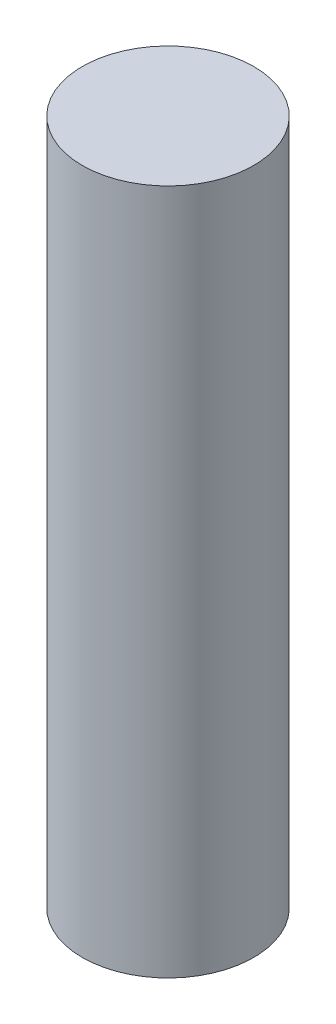
ISO-10303-21;
HEADER;
FILE_DESCRIPTION(('STEP AP214'),'2;1');
FILE_NAME('part.step','',(''),(''),'','','');
FILE_SCHEMA(('AUTOMOTIVE_DESIGN { 1 0 10303 214 1 1 1 1 }'));
ENDSEC;
DATA;
#1=APPLICATION_CONTEXT('core data for automotive mechanical design processes');
#2=APPLICATION_PROTOCOL_DEFINITION('international standard','automotive_design',2000,#1);
#3=PRODUCT_CONTEXT('',#1,'mechanical');
#4=PRODUCT('Part','Part','',(#3));
#5=PRODUCT_RELATED_PRODUCT_CATEGORY('part','',(#4));
#6=PRODUCT_DEFINITION_FORMATION('','',#4);
#7=PRODUCT_DEFINITION_CONTEXT('part definition',#1,'design');
#8=PRODUCT_DEFINITION('design','',#6,#7);
#9=PRODUCT_DEFINITION_SHAPE('','',#8);
#10=(LENGTH_UNIT() NAMED_UNIT(*) SI_UNIT(.MILLI.,.METRE.));
#11=(NAMED_UNIT(*) PLANE_ANGLE_UNIT() SI_UNIT($,.RADIAN.));
#12=(NAMED_UNIT(*) SI_UNIT($,.STERADIAN.) SOLID_ANGLE_UNIT());
#13=UNCERTAINTY_MEASURE_WITH_UNIT(LENGTH_MEASURE(1.E-05),#10,'distance_accuracy_value','');
#14=(GEOMETRIC_REPRESENTATION_CONTEXT(3) GLOBAL_UNCERTAINTY_ASSIGNED_CONTEXT((#13)) GLOBAL_UNIT_ASSIGNED_CONTEXT((#10,
#11,#12)) REPRESENTATION_CONTEXT('',''));
#15=CARTESIAN_POINT('',(0.,0.,0.));
#16=DIRECTION('',(0.,0.,1.));
#17=DIRECTION('',(1.,0.,0.));
#18=AXIS2_PLACEMENT_3D('',#15,#16,#17);
#19=CARTESIAN_POINT('',(0.,20.,0.));
#20=DIRECTION('',(0.,-1.,0.));
#21=DIRECTION('',(0.,0.,-1.));
#22=AXIS2_PLACEMENT_3D('',#19,#20,#21);
#23=CYLINDRICAL_SURFACE('',#22,5.);
#24=CARTESIAN_POINT('',(0.,20.,0.));
#25=DIRECTION('',(0.,1.,0.));
#26=DIRECTION('',(0.,0.,1.));
#27=AXIS2_PLACEMENT_3D('',#24,#25,#26);
#28=CIRCLE('',#27,5.);
#29=CARTESIAN_POINT('',(0.,20.,5.));
#30=VERTEX_POINT('',#29);
#31=EDGE_CURVE('E10',#30,#30,#28,.T.);
#32=ORIENTED_EDGE('',*,*,#31,.F.);
#33=EDGE_LOOP('',(#32));
#34=FACE_BOUND('',#33,.T.);
#35=CARTESIAN_POINT('',(0.,-20.,0.));
#36=DIRECTION('',(0.,1.,0.));
#37=DIRECTION('',(0.,0.,1.));
#38=AXIS2_PLACEMENT_3D('',#35,#36,#37);
#39=CIRCLE('',#38,5.);
#40=CARTESIAN_POINT('',(0.,-20.,5.));
#41=VERTEX_POINT('',#40);
#42=EDGE_CURVE('E40',#41,#41,#39,.T.);
#43=ORIENTED_EDGE('',*,*,#42,.T.);
#44=EDGE_LOOP('',(#43));
#45=FACE_BOUND('',#44,.T.);
#46=ADVANCED_FACE('F37',(#34,#45),#23,.T.);
#47=CARTESIAN_POINT('',(0.,20.,0.));
#48=DIRECTION('',(0.,1.,0.));
#49=DIRECTION('',(0.,0.,1.));
#50=AXIS2_PLACEMENT_3D('',#47,#48,#49);
#51=PLANE('',#50);
#52=ORIENTED_EDGE('',*,*,#31,.T.);
#53=EDGE_LOOP('',(#52));
#54=FACE_BOUND('',#53,.T.);
#55=ADVANCED_FACE('F54',(#54),#51,.T.);
#56=CARTESIAN_POINT('',(0.,-20.,0.));
#57=DIRECTION('',(0.,1.,0.));
#58=DIRECTION('',(0.,0.,1.));
#59=AXIS2_PLACEMENT_3D('',#56,#57,#58);
#60=PLANE('',#59);
#61=ORIENTED_EDGE('',*,*,#42,.F.);
#62=EDGE_LOOP('',(#61));
#63=FACE_BOUND('',#62,.T.);
#64=ADVANCED_FACE('F52',(#63),#60,.F.);
#65=CLOSED_SHELL('',(#46,#55,#64));
#66=MANIFOLD_SOLID_BREP('B2',#65);
#67=ADVANCED_BREP_SHAPE_REPRESENTATION('',(#18,#66),#14);
#68=SHAPE_DEFINITION_REPRESENTATION(#9,#67);
ENDSEC;
END-ISO-10303-21;
